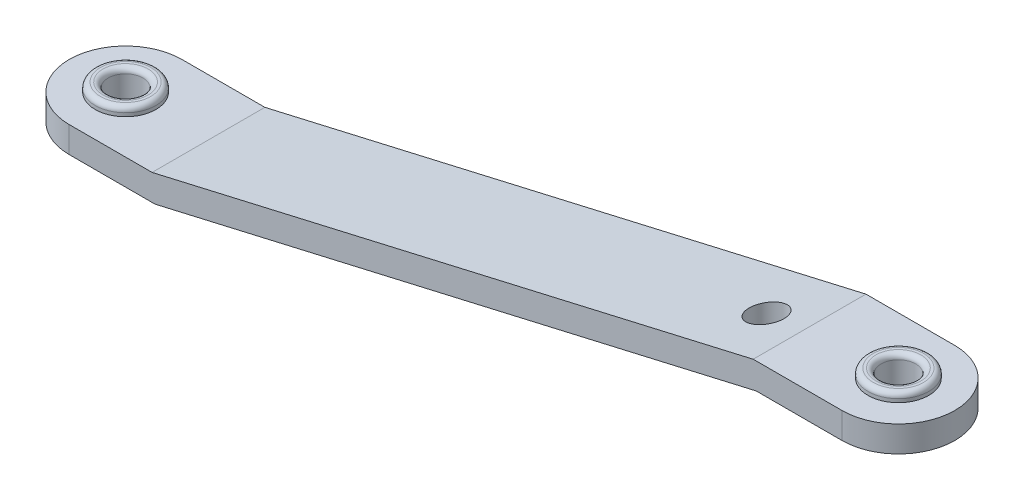
ISO-10303-21;
HEADER;
FILE_DESCRIPTION(('STEP AP214'),'2;1');
FILE_NAME('part.step','',(''),(''),'','','');
FILE_SCHEMA(('AUTOMOTIVE_DESIGN { 1 0 10303 214 1 1 1 1 }'));
ENDSEC;
DATA;
#1=APPLICATION_CONTEXT('core data for automotive mechanical design processes');
#2=APPLICATION_PROTOCOL_DEFINITION('international standard','automotive_design',2000,#1);
#3=PRODUCT_CONTEXT('',#1,'mechanical');
#4=PRODUCT('Part','Part','',(#3));
#5=PRODUCT_RELATED_PRODUCT_CATEGORY('part','',(#4));
#6=PRODUCT_DEFINITION_FORMATION('','',#4);
#7=PRODUCT_DEFINITION_CONTEXT('part definition',#1,'design');
#8=PRODUCT_DEFINITION('design','',#6,#7);
#9=PRODUCT_DEFINITION_SHAPE('','',#8);
#10=(LENGTH_UNIT() NAMED_UNIT(*) SI_UNIT(.MILLI.,.METRE.));
#11=(NAMED_UNIT(*) PLANE_ANGLE_UNIT() SI_UNIT($,.RADIAN.));
#12=(NAMED_UNIT(*) SI_UNIT($,.STERADIAN.) SOLID_ANGLE_UNIT());
#13=UNCERTAINTY_MEASURE_WITH_UNIT(LENGTH_MEASURE(1.E-05),#10,'distance_accuracy_value','');
#14=(GEOMETRIC_REPRESENTATION_CONTEXT(3) GLOBAL_UNCERTAINTY_ASSIGNED_CONTEXT((#13)) GLOBAL_UNIT_ASSIGNED_CONTEXT((#10,
#11,#12)) REPRESENTATION_CONTEXT('',''));
#15=CARTESIAN_POINT('',(0.,0.,0.));
#16=DIRECTION('',(0.,0.,1.));
#17=DIRECTION('',(1.,0.,0.));
#18=AXIS2_PLACEMENT_3D('',#15,#16,#17);
#19=CARTESIAN_POINT('',(396.018069942732,95.,0.));
#20=DIRECTION('',(0.,-1.,0.));
#21=DIRECTION('',(0.,0.,-1.));
#22=AXIS2_PLACEMENT_3D('',#19,#20,#21);
#23=CYLINDRICAL_SURFACE('',#22,32.5);
#24=DIRECTION('',(0.,-1.,0.));
#25=VECTOR('',#24,1.);
#26=CARTESIAN_POINT('',(396.018069942732,80.,-32.5));
#27=LINE('',#26,#25);
#28=CARTESIAN_POINT('',(396.018069942732,95.,-32.5));
#29=VERTEX_POINT('',#28);
#30=CARTESIAN_POINT('',(396.018069942732,80.,-32.5));
#31=VERTEX_POINT('',#30);
#32=EDGE_CURVE('E170',#29,#31,#27,.T.);
#33=ORIENTED_EDGE('',*,*,#32,.F.);
#34=CARTESIAN_POINT('',(396.018069942732,95.,0.));
#35=DIRECTION('',(0.,-1.,0.));
#36=DIRECTION('',(0.,0.,-1.));
#37=AXIS2_PLACEMENT_3D('',#34,#35,#36);
#38=CIRCLE('',#37,32.5);
#39=CARTESIAN_POINT('',(396.018069942732,95.,32.5));
#40=VERTEX_POINT('',#39);
#41=EDGE_CURVE('E58',#40,#29,#38,.F.);
#42=ORIENTED_EDGE('',*,*,#41,.F.);
#43=DIRECTION('',(0.,1.,0.));
#44=VECTOR('',#43,1.);
#45=CARTESIAN_POINT('',(396.018069942732,0.,32.5));
#46=LINE('',#45,#44);
#47=CARTESIAN_POINT('',(396.018069942732,80.,32.5));
#48=VERTEX_POINT('',#47);
#49=EDGE_CURVE('E172',#48,#40,#46,.T.);
#50=ORIENTED_EDGE('',*,*,#49,.F.);
#51=CARTESIAN_POINT('',(396.018069942732,80.,0.));
#52=DIRECTION('',(0.,-1.,0.));
#53=DIRECTION('',(0.,0.,-1.));
#54=AXIS2_PLACEMENT_3D('',#51,#52,#53);
#55=CIRCLE('',#54,32.5);
#56=EDGE_CURVE('E66',#31,#48,#55,.T.);
#57=ORIENTED_EDGE('',*,*,#56,.F.);
#58=EDGE_LOOP('',(#33,#42,#50,#57));
#59=FACE_BOUND('',#58,.T.);
#60=ADVANCED_FACE('F43',(#59),#23,.T.);
#61=CARTESIAN_POINT('',(-49.5,15.,0.));
#62=DIRECTION('',(0.,-1.,0.));
#63=DIRECTION('',(0.,0.,-1.));
#64=AXIS2_PLACEMENT_3D('',#61,#62,#63);
#65=CYLINDRICAL_SURFACE('',#64,32.5);
#66=DIRECTION('',(0.,1.,0.));
#67=VECTOR('',#66,1.);
#68=CARTESIAN_POINT('',(-49.5,0.,32.5));
#69=LINE('',#68,#67);
#70=CARTESIAN_POINT('',(-49.5,15.,32.5));
#71=VERTEX_POINT('',#70);
#72=CARTESIAN_POINT('',(-49.5,0.,32.5));
#73=VERTEX_POINT('',#72);
#74=EDGE_CURVE('E118',#71,#73,#69,.F.);
#75=ORIENTED_EDGE('',*,*,#74,.F.);
#76=CARTESIAN_POINT('',(-49.5,15.,0.));
#77=DIRECTION('',(0.,-1.,0.));
#78=DIRECTION('',(0.,0.,-1.));
#79=AXIS2_PLACEMENT_3D('',#76,#77,#78);
#80=CIRCLE('',#79,32.5);
#81=CARTESIAN_POINT('',(-49.5,15.,-32.5));
#82=VERTEX_POINT('',#81);
#83=EDGE_CURVE('E167',#82,#71,#80,.F.);
#84=ORIENTED_EDGE('',*,*,#83,.F.);
#85=DIRECTION('',(0.,-1.,0.));
#86=VECTOR('',#85,1.);
#87=CARTESIAN_POINT('',(-49.5,80.,-32.5));
#88=LINE('',#87,#86);
#89=CARTESIAN_POINT('',(-49.5,0.,-32.5));
#90=VERTEX_POINT('',#89);
#91=EDGE_CURVE('E165',#90,#82,#88,.F.);
#92=ORIENTED_EDGE('',*,*,#91,.F.);
#93=CARTESIAN_POINT('',(-49.5,0.,0.));
#94=DIRECTION('',(0.,-1.,0.));
#95=DIRECTION('',(0.,0.,-1.));
#96=AXIS2_PLACEMENT_3D('',#93,#94,#95);
#97=CIRCLE('',#96,32.5);
#98=EDGE_CURVE('E114',#73,#90,#97,.T.);
#99=ORIENTED_EDGE('',*,*,#98,.F.);
#100=EDGE_LOOP('',(#75,#84,#92,#99));
#101=FACE_BOUND('',#100,.T.);
#102=ADVANCED_FACE('F248',(#101),#65,.T.);
#103=CARTESIAN_POINT('',(346.518069942732,80.,-32.5));
#104=DIRECTION('',(0.,0.,-1.));
#105=DIRECTION('',(1.,0.,0.));
#106=AXIS2_PLACEMENT_3D('',#103,#104,#105);
#107=PLANE('',#106);
#108=DIRECTION('',(1.,0.,0.));
#109=VECTOR('',#108,1.);
#110=CARTESIAN_POINT('',(346.518069942732,95.,-32.5));
#111=LINE('',#110,#109);
#112=CARTESIAN_POINT('',(344.809035818207,95.,-32.5));
#113=VERTEX_POINT('',#112);
#114=EDGE_CURVE('E148',#113,#29,#111,.T.);
#115=ORIENTED_EDGE('',*,*,#114,.T.);
#116=ORIENTED_EDGE('',*,*,#32,.T.);
#117=DIRECTION('',(1.,0.,0.));
#118=VECTOR('',#117,1.);
#119=CARTESIAN_POINT('',(346.518069942732,80.,-32.5));
#120=LINE('',#119,#118);
#121=CARTESIAN_POINT('',(346.518069942732,80.,-32.5));
#122=VERTEX_POINT('',#121);
#123=EDGE_CURVE('E126',#122,#31,#120,.T.);
#124=ORIENTED_EDGE('',*,*,#123,.F.);
#125=DIRECTION('',(0.974370064785235,0.224951054343865,0.));
#126=VECTOR('',#125,1.);
#127=CARTESIAN_POINT('',(0.,0.,-32.5));
#128=LINE('',#127,#126);
#129=CARTESIAN_POINT('',(0.,0.,-32.5));
#130=VERTEX_POINT('',#129);
#131=EDGE_CURVE('E122',#130,#122,#128,.T.);
#132=ORIENTED_EDGE('',*,*,#131,.F.);
#133=DIRECTION('',(1.,0.,0.));
#134=VECTOR('',#133,1.);
#135=CARTESIAN_POINT('',(-82.,0.,-32.5));
#136=LINE('',#135,#134);
#137=EDGE_CURVE('E108',#90,#130,#136,.T.);
#138=ORIENTED_EDGE('',*,*,#137,.F.);
#139=ORIENTED_EDGE('',*,*,#91,.T.);
#140=DIRECTION('',(1.,0.,0.));
#141=VECTOR('',#140,1.);
#142=CARTESIAN_POINT('',(-82.,15.,-32.5));
#143=LINE('',#142,#141);
#144=CARTESIAN_POINT('',(-1.70903412452467,15.,-32.5));
#145=VERTEX_POINT('',#144);
#146=EDGE_CURVE('E152',#82,#145,#143,.T.);
#147=ORIENTED_EDGE('',*,*,#146,.T.);
#148=DIRECTION('',(0.974370064785235,0.224951054343865,0.));
#149=VECTOR('',#148,1.);
#150=CARTESIAN_POINT('',(-3.37426581515798,14.6155509717785,-32.5));
#151=LINE('',#150,#149);
#152=EDGE_CURVE('E144',#145,#113,#151,.T.);
#153=ORIENTED_EDGE('',*,*,#152,.T.);
#154=EDGE_LOOP('',(#115,#116,#124,#132,#138,#139,#147,#153));
#155=FACE_BOUND('',#154,.T.);
#156=ADVANCED_FACE('F124',(#155),#107,.T.);
#157=CARTESIAN_POINT('',(-82.,0.,32.5));
#158=DIRECTION('',(0.,0.,-1.));
#159=DIRECTION('',(1.,0.,0.));
#160=AXIS2_PLACEMENT_3D('',#157,#158,#159);
#161=PLANE('',#160);
#162=DIRECTION('',(1.,0.,0.));
#163=VECTOR('',#162,1.);
#164=CARTESIAN_POINT('',(346.518069942732,80.,32.5));
#165=LINE('',#164,#163);
#166=CARTESIAN_POINT('',(346.518069942732,80.,32.5));
#167=VERTEX_POINT('',#166);
#168=EDGE_CURVE('E162',#167,#48,#165,.T.);
#169=ORIENTED_EDGE('',*,*,#168,.T.);
#170=ORIENTED_EDGE('',*,*,#49,.T.);
#171=DIRECTION('',(1.,0.,0.));
#172=VECTOR('',#171,1.);
#173=CARTESIAN_POINT('',(346.518069942732,95.,32.5));
#174=LINE('',#173,#172);
#175=CARTESIAN_POINT('',(344.809035818207,95.,32.5));
#176=VERTEX_POINT('',#175);
#177=EDGE_CURVE('E149',#176,#40,#174,.T.);
#178=ORIENTED_EDGE('',*,*,#177,.F.);
#179=DIRECTION('',(0.974370064785235,0.224951054343865,0.));
#180=VECTOR('',#179,1.);
#181=CARTESIAN_POINT('',(-3.37426581515798,14.6155509717785,32.5));
#182=LINE('',#181,#180);
#183=CARTESIAN_POINT('',(-1.70903412452467,15.,32.5));
#184=VERTEX_POINT('',#183);
#185=EDGE_CURVE('E145',#184,#176,#182,.T.);
#186=ORIENTED_EDGE('',*,*,#185,.F.);
#187=DIRECTION('',(1.,0.,0.));
#188=VECTOR('',#187,1.);
#189=CARTESIAN_POINT('',(-82.,15.,32.5));
#190=LINE('',#189,#188);
#191=EDGE_CURVE('E150',#71,#184,#190,.T.);
#192=ORIENTED_EDGE('',*,*,#191,.F.);
#193=ORIENTED_EDGE('',*,*,#74,.T.);
#194=DIRECTION('',(1.,0.,0.));
#195=VECTOR('',#194,1.);
#196=CARTESIAN_POINT('',(-82.,0.,32.5));
#197=LINE('',#196,#195);
#198=CARTESIAN_POINT('',(0.,0.,32.5));
#199=VERTEX_POINT('',#198);
#200=EDGE_CURVE('E119',#73,#199,#197,.T.);
#201=ORIENTED_EDGE('',*,*,#200,.T.);
#202=DIRECTION('',(0.974370064785235,0.224951054343865,0.));
#203=VECTOR('',#202,1.);
#204=CARTESIAN_POINT('',(0.,0.,32.5));
#205=LINE('',#204,#203);
#206=EDGE_CURVE('E134',#199,#167,#205,.T.);
#207=ORIENTED_EDGE('',*,*,#206,.T.);
#208=EDGE_LOOP('',(#169,#170,#178,#186,#192,#193,#201,#207));
#209=FACE_BOUND('',#208,.T.);
#210=ADVANCED_FACE('F305',(#209),#161,.F.);
#211=CARTESIAN_POINT('',(-82.,0.,-32.5));
#212=DIRECTION('',(0.,-1.,0.));
#213=DIRECTION('',(0.,0.,-1.));
#214=AXIS2_PLACEMENT_3D('',#211,#212,#213);
#215=PLANE('',#214);
#216=CARTESIAN_POINT('',(-49.5,0.,0.));
#217=DIRECTION('',(0.,-1.,0.));
#218=DIRECTION('',(0.,0.,-1.));
#219=AXIS2_PLACEMENT_3D('',#216,#217,#218);
#220=CIRCLE('',#219,17.5);
#221=CARTESIAN_POINT('',(-49.5,0.,-17.5));
#222=VERTEX_POINT('',#221);
#223=EDGE_CURVE('E176',#222,#222,#220,.T.);
#224=ORIENTED_EDGE('',*,*,#223,.F.);
#225=EDGE_LOOP('',(#224));
#226=FACE_BOUND('',#225,.T.);
#227=ORIENTED_EDGE('',*,*,#200,.F.);
#228=ORIENTED_EDGE('',*,*,#98,.T.);
#229=ORIENTED_EDGE('',*,*,#137,.T.);
#230=DIRECTION('',(0.,0.,1.));
#231=VECTOR('',#230,1.);
#232=CARTESIAN_POINT('',(0.,0.,-32.5));
#233=LINE('',#232,#231);
#234=EDGE_CURVE('E113',#130,#199,#233,.T.);
#235=ORIENTED_EDGE('',*,*,#234,.T.);
#236=EDGE_LOOP('',(#227,#228,#229,#235));
#237=FACE_BOUND('',#236,.T.);
#238=ADVANCED_FACE('F111',(#226,#237),#215,.T.);
#239=CARTESIAN_POINT('',(0.,0.,-32.5));
#240=DIRECTION('',(0.224951054343865,-0.974370064785235,0.));
#241=DIRECTION('',(0.974370064785235,0.224951054343865,0.));
#242=AXIS2_PLACEMENT_3D('',#239,#240,#241);
#243=PLANE('',#242);
#244=CARTESIAN_POINT('',(320.,73.8778211601803,0.));
#245=DIRECTION('',(0.224951054343865,-0.974370064785235,0.));
#246=DIRECTION('',(0.974370064785235,0.224951054343865,0.));
#247=AXIS2_PLACEMENT_3D('',#244,#245,#246);
#248=ELLIPSE('',#247,10.2630410779339,9.99999999999998);
#249=CARTESIAN_POINT('',(330.,76.186503071436,0.));
#250=VERTEX_POINT('',#249);
#251=EDGE_CURVE('E157',#250,#250,#248,.T.);
#252=ORIENTED_EDGE('',*,*,#251,.F.);
#253=EDGE_LOOP('',(#252));
#254=FACE_BOUND('',#253,.T.);
#255=ORIENTED_EDGE('',*,*,#206,.F.);
#256=ORIENTED_EDGE('',*,*,#234,.F.);
#257=ORIENTED_EDGE('',*,*,#131,.T.);
#258=DIRECTION('',(0.,0.,1.));
#259=VECTOR('',#258,1.);
#260=CARTESIAN_POINT('',(346.518069942732,80.,-32.5));
#261=LINE('',#260,#259);
#262=EDGE_CURVE('E139',#122,#167,#261,.T.);
#263=ORIENTED_EDGE('',*,*,#262,.T.);
#264=EDGE_LOOP('',(#255,#256,#257,#263));
#265=FACE_BOUND('',#264,.T.);
#266=ADVANCED_FACE('F132',(#254,#265),#243,.T.);
#267=CARTESIAN_POINT('',(346.518069942732,80.,-32.5));
#268=DIRECTION('',(0.,-1.,0.));
#269=DIRECTION('',(0.,0.,-1.));
#270=AXIS2_PLACEMENT_3D('',#267,#268,#269);
#271=PLANE('',#270);
#272=CARTESIAN_POINT('',(396.018069942732,80.,0.));
#273=DIRECTION('',(0.,-1.,0.));
#274=DIRECTION('',(0.,0.,-1.));
#275=AXIS2_PLACEMENT_3D('',#272,#273,#274);
#276=CIRCLE('',#275,17.4999999999999);
#277=CARTESIAN_POINT('',(396.018069942732,80.,-17.4999999999999));
#278=VERTEX_POINT('',#277);
#279=EDGE_CURVE('E190',#278,#278,#276,.T.);
#280=ORIENTED_EDGE('',*,*,#279,.F.);
#281=EDGE_LOOP('',(#280));
#282=FACE_BOUND('',#281,.T.);
#283=ORIENTED_EDGE('',*,*,#123,.T.);
#284=ORIENTED_EDGE('',*,*,#56,.T.);
#285=ORIENTED_EDGE('',*,*,#168,.F.);
#286=ORIENTED_EDGE('',*,*,#262,.F.);
#287=EDGE_LOOP('',(#283,#284,#285,#286));
#288=FACE_BOUND('',#287,.T.);
#289=ADVANCED_FACE('F304',(#282,#288),#271,.T.);
#290=CARTESIAN_POINT('',(-82.,15.,-32.5));
#291=DIRECTION('',(0.,-1.,0.));
#292=DIRECTION('',(0.,0.,-1.));
#293=AXIS2_PLACEMENT_3D('',#290,#291,#292);
#294=PLANE('',#293);
#295=CARTESIAN_POINT('',(-49.5,15.,0.));
#296=DIRECTION('',(0.,-1.,0.));
#297=DIRECTION('',(0.,0.,-1.));
#298=AXIS2_PLACEMENT_3D('',#295,#296,#297);
#299=CIRCLE('',#298,17.5);
#300=CARTESIAN_POINT('',(-49.5,15.,-17.5));
#301=VERTEX_POINT('',#300);
#302=EDGE_CURVE('E180',#301,#301,#299,.T.);
#303=ORIENTED_EDGE('',*,*,#302,.T.);
#304=EDGE_LOOP('',(#303));
#305=FACE_BOUND('',#304,.T.);
#306=ORIENTED_EDGE('',*,*,#146,.F.);
#307=ORIENTED_EDGE('',*,*,#83,.T.);
#308=ORIENTED_EDGE('',*,*,#191,.T.);
#309=DIRECTION('',(0.,0.,1.));
#310=VECTOR('',#309,1.);
#311=CARTESIAN_POINT('',(-1.70903412452467,15.,-32.5));
#312=LINE('',#311,#310);
#313=EDGE_CURVE('E141',#145,#184,#312,.T.);
#314=ORIENTED_EDGE('',*,*,#313,.F.);
#315=EDGE_LOOP('',(#306,#307,#308,#314));
#316=FACE_BOUND('',#315,.T.);
#317=ADVANCED_FACE('F312',(#305,#316),#294,.F.);
#318=CARTESIAN_POINT('',(-3.37426581515798,14.6155509717785,-32.5));
#319=DIRECTION('',(0.224951054343865,-0.974370064785235,0.));
#320=DIRECTION('',(0.974370064785235,0.224951054343865,0.));
#321=AXIS2_PLACEMENT_3D('',#318,#319,#320);
#322=PLANE('',#321);
#323=CARTESIAN_POINT('',(320.,89.2723827770812,0.));
#324=DIRECTION('',(0.224951054343865,-0.974370064785235,0.));
#325=DIRECTION('',(0.974370064785235,0.224951054343865,0.));
#326=AXIS2_PLACEMENT_3D('',#323,#324,#325);
#327=ELLIPSE('',#326,10.2630410779339,9.99999999999998);
#328=CARTESIAN_POINT('',(330.,91.5810646883368,0.));
#329=VERTEX_POINT('',#328);
#330=EDGE_CURVE('E177',#329,#329,#327,.T.);
#331=ORIENTED_EDGE('',*,*,#330,.T.);
#332=EDGE_LOOP('',(#331));
#333=FACE_BOUND('',#332,.T.);
#334=ORIENTED_EDGE('',*,*,#185,.T.);
#335=DIRECTION('',(0.,0.,1.));
#336=VECTOR('',#335,1.);
#337=CARTESIAN_POINT('',(344.809035818207,95.,-32.5));
#338=LINE('',#337,#336);
#339=EDGE_CURVE('E146',#113,#176,#338,.T.);
#340=ORIENTED_EDGE('',*,*,#339,.F.);
#341=ORIENTED_EDGE('',*,*,#152,.F.);
#342=ORIENTED_EDGE('',*,*,#313,.T.);
#343=EDGE_LOOP('',(#334,#340,#341,#342));
#344=FACE_BOUND('',#343,.T.);
#345=ADVANCED_FACE('F315',(#333,#344),#322,.F.);
#346=CARTESIAN_POINT('',(346.518069942732,95.,-32.5));
#347=DIRECTION('',(0.,-1.,0.));
#348=DIRECTION('',(0.,0.,-1.));
#349=AXIS2_PLACEMENT_3D('',#346,#347,#348);
#350=PLANE('',#349);
#351=CARTESIAN_POINT('',(396.018069942732,95.,0.));
#352=DIRECTION('',(0.,-1.,0.));
#353=DIRECTION('',(0.,0.,-1.));
#354=AXIS2_PLACEMENT_3D('',#351,#352,#353);
#355=CIRCLE('',#354,17.4999999999999);
#356=CARTESIAN_POINT('',(396.018069942732,95.,-17.4999999999999));
#357=VERTEX_POINT('',#356);
#358=EDGE_CURVE('E183',#357,#357,#355,.T.);
#359=ORIENTED_EDGE('',*,*,#358,.T.);
#360=EDGE_LOOP('',(#359));
#361=FACE_BOUND('',#360,.T.);
#362=ORIENTED_EDGE('',*,*,#177,.T.);
#363=ORIENTED_EDGE('',*,*,#41,.T.);
#364=ORIENTED_EDGE('',*,*,#114,.F.);
#365=ORIENTED_EDGE('',*,*,#339,.T.);
#366=EDGE_LOOP('',(#362,#363,#364,#365));
#367=FACE_BOUND('',#366,.T.);
#368=ADVANCED_FACE('F318',(#361,#367),#350,.F.);
#369=CARTESIAN_POINT('',(320.,0.,0.));
#370=DIRECTION('',(0.,1.,0.));
#371=DIRECTION('',(-1.,0.,0.));
#372=AXIS2_PLACEMENT_3D('',#369,#370,#371);
#373=CYLINDRICAL_SURFACE('',#372,9.99999999999998);
#374=ORIENTED_EDGE('',*,*,#251,.T.);
#375=EDGE_LOOP('',(#374));
#376=FACE_BOUND('',#375,.T.);
#377=ORIENTED_EDGE('',*,*,#330,.F.);
#378=EDGE_LOOP('',(#377));
#379=FACE_BOUND('',#378,.T.);
#380=ADVANCED_FACE('F321',(#376,#379),#373,.F.);
#381=CARTESIAN_POINT('',(0.,20.,0.));
#382=DIRECTION('',(0.,1.,0.));
#383=DIRECTION('',(0.,0.,1.));
#384=AXIS2_PLACEMENT_3D('',#381,#382,#383);
#385=PLANE('',#384);
#386=CARTESIAN_POINT('',(-49.5,20.,0.));
#387=DIRECTION('',(0.,1.,0.));
#388=DIRECTION('',(0.,0.,1.));
#389=AXIS2_PLACEMENT_3D('',#386,#387,#388);
#390=CIRCLE('',#389,14.5);
#391=CARTESIAN_POINT('',(-49.5,20.,14.5));
#392=VERTEX_POINT('',#391);
#393=EDGE_CURVE('E189',#392,#392,#390,.T.);
#394=ORIENTED_EDGE('',*,*,#393,.T.);
#395=EDGE_LOOP('',(#394));
#396=FACE_BOUND('',#395,.T.);
#397=CARTESIAN_POINT('',(-49.5,20.,0.));
#398=DIRECTION('',(0.,1.,0.));
#399=DIRECTION('',(0.,0.,1.));
#400=AXIS2_PLACEMENT_3D('',#397,#398,#399);
#401=CIRCLE('',#400,13.);
#402=CARTESIAN_POINT('',(-49.5,20.,13.));
#403=VERTEX_POINT('',#402);
#404=EDGE_CURVE('E186',#403,#403,#401,.F.);
#405=ORIENTED_EDGE('',*,*,#404,.T.);
#406=EDGE_LOOP('',(#405));
#407=FACE_BOUND('',#406,.T.);
#408=ADVANCED_FACE('F328',(#396,#407),#385,.T.);
#409=CARTESIAN_POINT('',(-49.5,-5.,0.));
#410=DIRECTION('',(0.,1.,0.));
#411=DIRECTION('',(0.,0.,1.));
#412=AXIS2_PLACEMENT_3D('',#409,#410,#411);
#413=CYLINDRICAL_SURFACE('',#412,17.5);
#414=CARTESIAN_POINT('',(-49.5,17.,0.));
#415=DIRECTION('',(0.,1.,0.));
#416=DIRECTION('',(0.,0.,1.));
#417=AXIS2_PLACEMENT_3D('',#414,#415,#416);
#418=CIRCLE('',#417,17.5);
#419=CARTESIAN_POINT('',(-49.5,17.,17.5));
#420=VERTEX_POINT('',#419);
#421=EDGE_CURVE('E193',#420,#420,#418,.F.);
#422=ORIENTED_EDGE('',*,*,#421,.T.);
#423=EDGE_LOOP('',(#422));
#424=FACE_BOUND('',#423,.T.);
#425=ORIENTED_EDGE('',*,*,#302,.F.);
#426=EDGE_LOOP('',(#425));
#427=FACE_BOUND('',#426,.T.);
#428=ADVANCED_FACE('F394',(#424,#427),#413,.T.);
#429=CARTESIAN_POINT('',(-49.5,-1.66533453693773E-13,0.));
#430=DIRECTION('',(0.,1.,0.));
#431=DIRECTION('',(-1.,0.,0.));
#432=AXIS2_PLACEMENT_3D('',#429,#430,#431);
#433=CYLINDRICAL_SURFACE('',#432,10.);
#434=CARTESIAN_POINT('',(-49.5,17.,0.));
#435=DIRECTION('',(0.,1.,0.));
#436=DIRECTION('',(0.,0.,1.));
#437=AXIS2_PLACEMENT_3D('',#434,#435,#436);
#438=CIRCLE('',#437,10.);
#439=CARTESIAN_POINT('',(-49.5,17.,10.));
#440=VERTEX_POINT('',#439);
#441=EDGE_CURVE('E199',#440,#440,#438,.T.);
#442=ORIENTED_EDGE('',*,*,#441,.T.);
#443=EDGE_LOOP('',(#442));
#444=FACE_BOUND('',#443,.T.);
#445=CARTESIAN_POINT('',(-49.5,-2.,0.));
#446=DIRECTION('',(0.,1.,0.));
#447=DIRECTION('',(0.,0.,1.));
#448=AXIS2_PLACEMENT_3D('',#445,#446,#447);
#449=CIRCLE('',#448,10.);
#450=CARTESIAN_POINT('',(-49.5,-2.,10.));
#451=VERTEX_POINT('',#450);
#452=EDGE_CURVE('E196',#451,#451,#449,.F.);
#453=ORIENTED_EDGE('',*,*,#452,.T.);
#454=EDGE_LOOP('',(#453));
#455=FACE_BOUND('',#454,.T.);
#456=ADVANCED_FACE('F402',(#444,#455),#433,.F.);
#457=CARTESIAN_POINT('',(-49.5,-2.,0.));
#458=DIRECTION('',(0.,1.,0.));
#459=DIRECTION('',(0.,0.,1.));
#460=AXIS2_PLACEMENT_3D('',#457,#458,#459);
#461=CIRCLE('',#460,17.5);
#462=CARTESIAN_POINT('',(-49.5,-2.,17.5));
#463=VERTEX_POINT('',#462);
#464=EDGE_CURVE('E202',#463,#463,#461,.T.);
#465=ORIENTED_EDGE('',*,*,#464,.T.);
#466=EDGE_LOOP('',(#465));
#467=FACE_BOUND('',#466,.T.);
#468=ORIENTED_EDGE('',*,*,#223,.T.);
#469=EDGE_LOOP('',(#468));
#470=FACE_BOUND('',#469,.T.);
#471=ADVANCED_FACE('F405',(#467,#470),#413,.T.);
#472=CARTESIAN_POINT('',(0.,-5.,0.));
#473=DIRECTION('',(0.,1.,0.));
#474=DIRECTION('',(0.,0.,1.));
#475=AXIS2_PLACEMENT_3D('',#472,#473,#474);
#476=PLANE('',#475);
#477=CARTESIAN_POINT('',(-49.5,-5.,0.));
#478=DIRECTION('',(0.,1.,0.));
#479=DIRECTION('',(0.,0.,1.));
#480=AXIS2_PLACEMENT_3D('',#477,#478,#479);
#481=CIRCLE('',#480,14.5);
#482=CARTESIAN_POINT('',(-49.5,-5.,14.5));
#483=VERTEX_POINT('',#482);
#484=EDGE_CURVE('E208',#483,#483,#481,.F.);
#485=ORIENTED_EDGE('',*,*,#484,.T.);
#486=EDGE_LOOP('',(#485));
#487=FACE_BOUND('',#486,.T.);
#488=CARTESIAN_POINT('',(-49.5,-5.,0.));
#489=DIRECTION('',(0.,1.,0.));
#490=DIRECTION('',(0.,0.,1.));
#491=AXIS2_PLACEMENT_3D('',#488,#489,#490);
#492=CIRCLE('',#491,13.);
#493=CARTESIAN_POINT('',(-49.5,-5.,13.));
#494=VERTEX_POINT('',#493);
#495=EDGE_CURVE('E205',#494,#494,#492,.T.);
#496=ORIENTED_EDGE('',*,*,#495,.T.);
#497=EDGE_LOOP('',(#496));
#498=FACE_BOUND('',#497,.T.);
#499=ADVANCED_FACE('F418',(#487,#498),#476,.F.);
#500=CARTESIAN_POINT('',(0.,100.,0.));
#501=DIRECTION('',(0.,1.,0.));
#502=DIRECTION('',(-1.,0.,0.));
#503=AXIS2_PLACEMENT_3D('',#500,#501,#502);
#504=PLANE('',#503);
#505=CARTESIAN_POINT('',(396.018069942732,100.,0.));
#506=DIRECTION('',(0.,1.,0.));
#507=DIRECTION('',(-1.,0.,0.));
#508=AXIS2_PLACEMENT_3D('',#505,#506,#507);
#509=CIRCLE('',#508,14.4999999999999);
#510=CARTESIAN_POINT('',(381.518069942732,100.,0.));
#511=VERTEX_POINT('',#510);
#512=EDGE_CURVE('E51',#511,#511,#509,.T.);
#513=ORIENTED_EDGE('',*,*,#512,.T.);
#514=EDGE_LOOP('',(#513));
#515=FACE_BOUND('',#514,.T.);
#516=CARTESIAN_POINT('',(396.018069942732,100.,0.));
#517=DIRECTION('',(0.,1.,0.));
#518=DIRECTION('',(-1.,0.,0.));
#519=AXIS2_PLACEMENT_3D('',#516,#517,#518);
#520=CIRCLE('',#519,13.);
#521=CARTESIAN_POINT('',(383.018069942732,100.,0.));
#522=VERTEX_POINT('',#521);
#523=EDGE_CURVE('E226',#522,#522,#520,.F.);
#524=ORIENTED_EDGE('',*,*,#523,.T.);
#525=EDGE_LOOP('',(#524));
#526=FACE_BOUND('',#525,.T.);
#527=ADVANCED_FACE('F231',(#515,#526),#504,.T.);
#528=CARTESIAN_POINT('',(396.018069942732,75.0000000000001,0.));
#529=DIRECTION('',(0.,1.,0.));
#530=DIRECTION('',(-1.,0.,0.));
#531=AXIS2_PLACEMENT_3D('',#528,#529,#530);
#532=CYLINDRICAL_SURFACE('',#531,17.4999999999999);
#533=CARTESIAN_POINT('',(396.018069942732,97.0000000000001,0.));
#534=DIRECTION('',(0.,1.,0.));
#535=DIRECTION('',(-1.,0.,0.));
#536=AXIS2_PLACEMENT_3D('',#533,#534,#535);
#537=CIRCLE('',#536,17.4999999999999);
#538=CARTESIAN_POINT('',(378.518069942732,97.0000000000001,0.));
#539=VERTEX_POINT('',#538);
#540=EDGE_CURVE('E11',#539,#539,#537,.F.);
#541=ORIENTED_EDGE('',*,*,#540,.T.);
#542=EDGE_LOOP('',(#541));
#543=FACE_BOUND('',#542,.T.);
#544=ORIENTED_EDGE('',*,*,#358,.F.);
#545=EDGE_LOOP('',(#544));
#546=FACE_BOUND('',#545,.T.);
#547=ADVANCED_FACE('F291',(#543,#546),#532,.T.);
#548=CARTESIAN_POINT('',(396.018069942732,0.,0.));
#549=DIRECTION('',(0.,1.,0.));
#550=DIRECTION('',(-1.,0.,0.));
#551=AXIS2_PLACEMENT_3D('',#548,#549,#550);
#552=CYLINDRICAL_SURFACE('',#551,9.99999999999998);
#553=CARTESIAN_POINT('',(396.018069942732,78.0000000000001,0.));
#554=DIRECTION('',(0.,1.,0.));
#555=DIRECTION('',(-1.,0.,0.));
#556=AXIS2_PLACEMENT_3D('',#553,#554,#555);
#557=CIRCLE('',#556,9.99999999999998);
#558=CARTESIAN_POINT('',(386.018069942732,78.0000000000001,0.));
#559=VERTEX_POINT('',#558);
#560=EDGE_CURVE('E223',#559,#559,#557,.F.);
#561=ORIENTED_EDGE('',*,*,#560,.T.);
#562=EDGE_LOOP('',(#561));
#563=FACE_BOUND('',#562,.T.);
#564=CARTESIAN_POINT('',(396.018069942732,97.0000000000001,0.));
#565=DIRECTION('',(0.,1.,0.));
#566=DIRECTION('',(-1.,0.,0.));
#567=AXIS2_PLACEMENT_3D('',#564,#565,#566);
#568=CIRCLE('',#567,9.99999999999998);
#569=CARTESIAN_POINT('',(386.018069942732,97.0000000000001,0.));
#570=VERTEX_POINT('',#569);
#571=EDGE_CURVE('E220',#570,#570,#568,.T.);
#572=ORIENTED_EDGE('',*,*,#571,.T.);
#573=EDGE_LOOP('',(#572));
#574=FACE_BOUND('',#573,.T.);
#575=ADVANCED_FACE('F289',(#563,#574),#552,.F.);
#576=CARTESIAN_POINT('',(396.018069942732,78.0000000000001,0.));
#577=DIRECTION('',(0.,1.,0.));
#578=DIRECTION('',(-1.,0.,0.));
#579=AXIS2_PLACEMENT_3D('',#576,#577,#578);
#580=CIRCLE('',#579,17.4999999999999);
#581=CARTESIAN_POINT('',(378.518069942732,78.0000000000001,0.));
#582=VERTEX_POINT('',#581);
#583=EDGE_CURVE('E211',#582,#582,#580,.T.);
#584=ORIENTED_EDGE('',*,*,#583,.T.);
#585=EDGE_LOOP('',(#584));
#586=FACE_BOUND('',#585,.T.);
#587=ORIENTED_EDGE('',*,*,#279,.T.);
#588=EDGE_LOOP('',(#587));
#589=FACE_BOUND('',#588,.T.);
#590=ADVANCED_FACE('F286',(#586,#589),#532,.T.);
#591=CARTESIAN_POINT('',(0.,75.,0.));
#592=DIRECTION('',(0.,1.,0.));
#593=DIRECTION('',(-1.,0.,0.));
#594=AXIS2_PLACEMENT_3D('',#591,#592,#593);
#595=PLANE('',#594);
#596=CARTESIAN_POINT('',(396.018069942732,75.0000000000001,0.));
#597=DIRECTION('',(0.,1.,0.));
#598=DIRECTION('',(-1.,0.,0.));
#599=AXIS2_PLACEMENT_3D('',#596,#597,#598);
#600=CIRCLE('',#599,14.4999999999999);
#601=CARTESIAN_POINT('',(381.518069942732,75.0000000000001,0.));
#602=VERTEX_POINT('',#601);
#603=EDGE_CURVE('E217',#602,#602,#600,.F.);
#604=ORIENTED_EDGE('',*,*,#603,.T.);
#605=EDGE_LOOP('',(#604));
#606=FACE_BOUND('',#605,.T.);
#607=CARTESIAN_POINT('',(396.018069942732,75.0000000000001,0.));
#608=DIRECTION('',(0.,1.,0.));
#609=DIRECTION('',(-1.,0.,0.));
#610=AXIS2_PLACEMENT_3D('',#607,#608,#609);
#611=CIRCLE('',#610,13.);
#612=CARTESIAN_POINT('',(383.018069942732,75.0000000000001,0.));
#613=VERTEX_POINT('',#612);
#614=EDGE_CURVE('E214',#613,#613,#611,.T.);
#615=ORIENTED_EDGE('',*,*,#614,.T.);
#616=EDGE_LOOP('',(#615));
#617=FACE_BOUND('',#616,.T.);
#618=ADVANCED_FACE('F265',(#606,#617),#595,.F.);
#619=CARTESIAN_POINT('',(-49.5,17.,0.));
#620=DIRECTION('',(0.,1.,0.));
#621=DIRECTION('',(0.,0.,1.));
#622=AXIS2_PLACEMENT_3D('',#619,#620,#621);
#623=TOROIDAL_SURFACE('',#622,14.5,3.);
#624=ORIENTED_EDGE('',*,*,#421,.F.);
#625=EDGE_LOOP('',(#624));
#626=FACE_BOUND('',#625,.T.);
#627=ORIENTED_EDGE('',*,*,#393,.F.);
#628=EDGE_LOOP('',(#627));
#629=FACE_BOUND('',#628,.T.);
#630=ADVANCED_FACE('F261',(#626,#629),#623,.T.);
#631=CARTESIAN_POINT('',(-49.5,17.,0.));
#632=DIRECTION('',(0.,1.,0.));
#633=DIRECTION('',(0.,0.,1.));
#634=AXIS2_PLACEMENT_3D('',#631,#632,#633);
#635=TOROIDAL_SURFACE('',#634,13.,3.);
#636=ORIENTED_EDGE('',*,*,#441,.F.);
#637=EDGE_LOOP('',(#636));
#638=FACE_BOUND('',#637,.T.);
#639=ORIENTED_EDGE('',*,*,#404,.F.);
#640=EDGE_LOOP('',(#639));
#641=FACE_BOUND('',#640,.T.);
#642=ADVANCED_FACE('F264',(#638,#641),#635,.T.);
#643=CARTESIAN_POINT('',(-49.5,-2.,0.));
#644=DIRECTION('',(0.,1.,0.));
#645=DIRECTION('',(0.,0.,1.));
#646=AXIS2_PLACEMENT_3D('',#643,#644,#645);
#647=TOROIDAL_SURFACE('',#646,14.5,3.);
#648=ORIENTED_EDGE('',*,*,#484,.F.);
#649=EDGE_LOOP('',(#648));
#650=FACE_BOUND('',#649,.T.);
#651=ORIENTED_EDGE('',*,*,#464,.F.);
#652=EDGE_LOOP('',(#651));
#653=FACE_BOUND('',#652,.T.);
#654=ADVANCED_FACE('F269',(#650,#653),#647,.T.);
#655=CARTESIAN_POINT('',(-49.5,-2.,0.));
#656=DIRECTION('',(0.,1.,0.));
#657=DIRECTION('',(0.,0.,1.));
#658=AXIS2_PLACEMENT_3D('',#655,#656,#657);
#659=TOROIDAL_SURFACE('',#658,13.,3.);
#660=ORIENTED_EDGE('',*,*,#495,.F.);
#661=EDGE_LOOP('',(#660));
#662=FACE_BOUND('',#661,.T.);
#663=ORIENTED_EDGE('',*,*,#452,.F.);
#664=EDGE_LOOP('',(#663));
#665=FACE_BOUND('',#664,.T.);
#666=ADVANCED_FACE('F273',(#662,#665),#659,.T.);
#667=CARTESIAN_POINT('',(396.018069942732,78.0000000000001,0.));
#668=DIRECTION('',(0.,1.,0.));
#669=DIRECTION('',(-1.,0.,0.));
#670=AXIS2_PLACEMENT_3D('',#667,#668,#669);
#671=TOROIDAL_SURFACE('',#670,14.4999999999999,3.);
#672=ORIENTED_EDGE('',*,*,#603,.F.);
#673=EDGE_LOOP('',(#672));
#674=FACE_BOUND('',#673,.T.);
#675=ORIENTED_EDGE('',*,*,#583,.F.);
#676=EDGE_LOOP('',(#675));
#677=FACE_BOUND('',#676,.T.);
#678=ADVANCED_FACE('F243',(#674,#677),#671,.T.);
#679=CARTESIAN_POINT('',(396.018069942732,78.0000000000001,0.));
#680=DIRECTION('',(0.,1.,0.));
#681=DIRECTION('',(-1.,0.,0.));
#682=AXIS2_PLACEMENT_3D('',#679,#680,#681);
#683=TOROIDAL_SURFACE('',#682,13.,3.);
#684=ORIENTED_EDGE('',*,*,#614,.F.);
#685=EDGE_LOOP('',(#684));
#686=FACE_BOUND('',#685,.T.);
#687=ORIENTED_EDGE('',*,*,#560,.F.);
#688=EDGE_LOOP('',(#687));
#689=FACE_BOUND('',#688,.T.);
#690=ADVANCED_FACE('F236',(#686,#689),#683,.T.);
#691=CARTESIAN_POINT('',(396.018069942732,97.0000000000001,0.));
#692=DIRECTION('',(0.,1.,0.));
#693=DIRECTION('',(-1.,0.,0.));
#694=AXIS2_PLACEMENT_3D('',#691,#692,#693);
#695=TOROIDAL_SURFACE('',#694,14.4999999999999,3.);
#696=ORIENTED_EDGE('',*,*,#540,.F.);
#697=EDGE_LOOP('',(#696));
#698=FACE_BOUND('',#697,.T.);
#699=ORIENTED_EDGE('',*,*,#512,.F.);
#700=EDGE_LOOP('',(#699));
#701=FACE_BOUND('',#700,.T.);
#702=ADVANCED_FACE('F234',(#698,#701),#695,.T.);
#703=CARTESIAN_POINT('',(396.018069942732,97.0000000000001,0.));
#704=DIRECTION('',(0.,1.,0.));
#705=DIRECTION('',(-1.,0.,0.));
#706=AXIS2_PLACEMENT_3D('',#703,#704,#705);
#707=TOROIDAL_SURFACE('',#706,13.,3.);
#708=ORIENTED_EDGE('',*,*,#571,.F.);
#709=EDGE_LOOP('',(#708));
#710=FACE_BOUND('',#709,.T.);
#711=ORIENTED_EDGE('',*,*,#523,.F.);
#712=EDGE_LOOP('',(#711));
#713=FACE_BOUND('',#712,.T.);
#714=ADVANCED_FACE('F45',(#710,#713),#707,.T.);
#715=CLOSED_SHELL('',(#60,#102,#156,#210,#238,#266,#289,#317,#345,#368,#380,#408,#428,#456,#471,
#499,#527,#547,#575,#590,#618,#630,#642,#654,#666,#678,#690,#702,#714));
#716=MANIFOLD_SOLID_BREP('B2',#715);
#717=ADVANCED_BREP_SHAPE_REPRESENTATION('',(#18,#716),#14);
#718=SHAPE_DEFINITION_REPRESENTATION(#9,#717);
ENDSEC;
END-ISO-10303-21;
